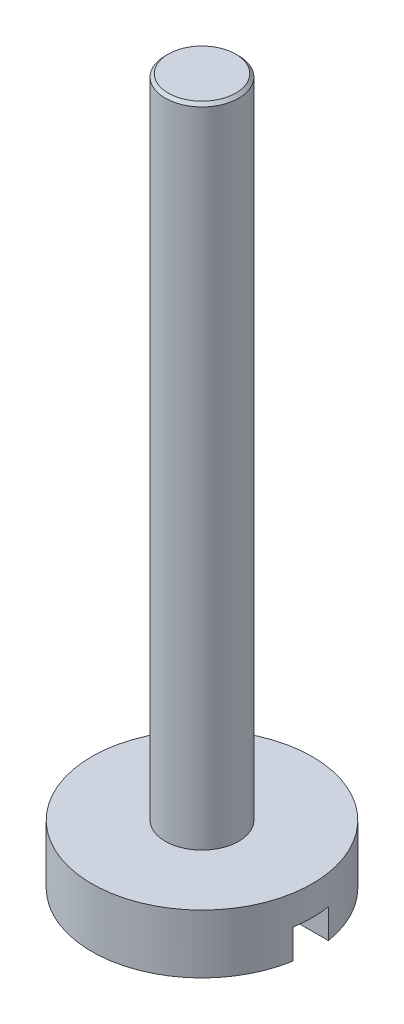
ISO-10303-21;
HEADER;
FILE_DESCRIPTION(('STEP AP214'),'2;1');
FILE_NAME('part.step','',(''),(''),'','','');
FILE_SCHEMA(('AUTOMOTIVE_DESIGN { 1 0 10303 214 1 1 1 1 }'));
ENDSEC;
DATA;
#1=APPLICATION_CONTEXT('core data for automotive mechanical design processes');
#2=APPLICATION_PROTOCOL_DEFINITION('international standard','automotive_design',2000,#1);
#3=PRODUCT_CONTEXT('',#1,'mechanical');
#4=PRODUCT('Part','Part','',(#3));
#5=PRODUCT_RELATED_PRODUCT_CATEGORY('part','',(#4));
#6=PRODUCT_DEFINITION_FORMATION('','',#4);
#7=PRODUCT_DEFINITION_CONTEXT('part definition',#1,'design');
#8=PRODUCT_DEFINITION('design','',#6,#7);
#9=PRODUCT_DEFINITION_SHAPE('','',#8);
#10=(LENGTH_UNIT() NAMED_UNIT(*) SI_UNIT(.MILLI.,.METRE.));
#11=(NAMED_UNIT(*) PLANE_ANGLE_UNIT() SI_UNIT($,.RADIAN.));
#12=(NAMED_UNIT(*) SI_UNIT($,.STERADIAN.) SOLID_ANGLE_UNIT());
#13=UNCERTAINTY_MEASURE_WITH_UNIT(LENGTH_MEASURE(1.E-05),#10,'distance_accuracy_value','');
#14=(GEOMETRIC_REPRESENTATION_CONTEXT(3) GLOBAL_UNCERTAINTY_ASSIGNED_CONTEXT((#13)) GLOBAL_UNIT_ASSIGNED_CONTEXT((#10,
#11,#12)) REPRESENTATION_CONTEXT('',''));
#15=CARTESIAN_POINT('',(0.,0.,0.));
#16=DIRECTION('',(0.,0.,1.));
#17=DIRECTION('',(1.,0.,0.));
#18=AXIS2_PLACEMENT_3D('',#15,#16,#17);
#19=CARTESIAN_POINT('',(0.,-1.,0.));
#20=DIRECTION('',(0.,-1.,0.));
#21=DIRECTION('',(0.,0.,-1.));
#22=AXIS2_PLACEMENT_3D('',#19,#20,#21);
#23=PLANE('',#22);
#24=DIRECTION('',(1.,0.,0.));
#25=VECTOR('',#24,1.);
#26=CARTESIAN_POINT('',(0.,-1.,-0.3));
#27=LINE('',#26,#25);
#28=CARTESIAN_POINT('',(-1.85084440188796,-1.,-0.3));
#29=VERTEX_POINT('',#28);
#30=CARTESIAN_POINT('',(1.85084440188796,-1.,-0.3));
#31=VERTEX_POINT('',#30);
#32=EDGE_CURVE('E90',#29,#31,#27,.T.);
#33=ORIENTED_EDGE('',*,*,#32,.F.);
#34=CARTESIAN_POINT('',(0.,-1.,0.));
#35=DIRECTION('',(0.,-1.,0.));
#36=DIRECTION('',(0.,0.,-1.));
#37=AXIS2_PLACEMENT_3D('',#34,#35,#36);
#38=CIRCLE('',#37,1.875);
#39=EDGE_CURVE('E100',#29,#31,#38,.T.);
#40=ORIENTED_EDGE('',*,*,#39,.T.);
#41=EDGE_LOOP('',(#33,#40));
#42=FACE_BOUND('',#41,.T.);
#43=ADVANCED_FACE('F42',(#42),#23,.T.);
#44=CARTESIAN_POINT('',(0.,-1.,0.));
#45=DIRECTION('',(0.,1.,0.));
#46=DIRECTION('',(0.,0.,1.));
#47=AXIS2_PLACEMENT_3D('',#44,#45,#46);
#48=CYLINDRICAL_SURFACE('',#47,1.875);
#49=CARTESIAN_POINT('',(0.,-0.5,0.));
#50=DIRECTION('',(0.,1.,0.));
#51=DIRECTION('',(0.,0.,1.));
#52=AXIS2_PLACEMENT_3D('',#49,#50,#51);
#53=CIRCLE('',#52,1.875);
#54=CARTESIAN_POINT('',(1.85084440188796,-0.5,0.3));
#55=VERTEX_POINT('',#54);
#56=CARTESIAN_POINT('',(1.85084440188796,-0.5,-0.3));
#57=VERTEX_POINT('',#56);
#58=EDGE_CURVE('E12',#55,#57,#53,.T.);
#59=ORIENTED_EDGE('',*,*,#58,.T.);
#60=DIRECTION('',(0.,1.,0.));
#61=VECTOR('',#60,1.);
#62=CARTESIAN_POINT('',(1.85084440188796,-1.,-0.3));
#63=LINE('',#62,#61);
#64=EDGE_CURVE('E65',#57,#31,#63,.F.);
#65=ORIENTED_EDGE('',*,*,#64,.T.);
#66=ORIENTED_EDGE('',*,*,#39,.F.);
#67=DIRECTION('',(0.,1.,0.));
#68=VECTOR('',#67,1.);
#69=CARTESIAN_POINT('',(-1.85084440188796,-1.,-0.3));
#70=LINE('',#69,#68);
#71=CARTESIAN_POINT('',(-1.85084440188796,-0.5,-0.3));
#72=VERTEX_POINT('',#71);
#73=EDGE_CURVE('E106',#29,#72,#70,.T.);
#74=ORIENTED_EDGE('',*,*,#73,.T.);
#75=CARTESIAN_POINT('',(-1.85084440188796,-0.5,0.3));
#76=VERTEX_POINT('',#75);
#77=EDGE_CURVE('E46',#72,#76,#53,.T.);
#78=ORIENTED_EDGE('',*,*,#77,.T.);
#79=DIRECTION('',(0.,1.,0.));
#80=VECTOR('',#79,1.);
#81=CARTESIAN_POINT('',(-1.85084440188796,-1.,0.3));
#82=LINE('',#81,#80);
#83=CARTESIAN_POINT('',(-1.85084440188796,-1.,0.3));
#84=VERTEX_POINT('',#83);
#85=EDGE_CURVE('E85',#76,#84,#82,.F.);
#86=ORIENTED_EDGE('',*,*,#85,.T.);
#87=CARTESIAN_POINT('',(1.85084440188796,-1.,0.3));
#88=VERTEX_POINT('',#87);
#89=EDGE_CURVE('E91',#88,#84,#38,.T.);
#90=ORIENTED_EDGE('',*,*,#89,.F.);
#91=DIRECTION('',(0.,1.,0.));
#92=VECTOR('',#91,1.);
#93=CARTESIAN_POINT('',(1.85084440188796,-1.,0.3));
#94=LINE('',#93,#92);
#95=EDGE_CURVE('E57',#88,#55,#94,.T.);
#96=ORIENTED_EDGE('',*,*,#95,.T.);
#97=EDGE_LOOP('',(#59,#65,#66,#74,#78,#86,#90,#96));
#98=FACE_BOUND('',#97,.T.);
#99=CARTESIAN_POINT('',(0.,0.,0.));
#100=DIRECTION('',(0.,-1.,0.));
#101=DIRECTION('',(0.,0.,-1.));
#102=AXIS2_PLACEMENT_3D('',#99,#100,#101);
#103=CIRCLE('',#102,1.875);
#104=CARTESIAN_POINT('',(0.,0.,-1.875));
#105=VERTEX_POINT('',#104);
#106=EDGE_CURVE('E103',#105,#105,#103,.T.);
#107=ORIENTED_EDGE('',*,*,#106,.T.);
#108=EDGE_LOOP('',(#107));
#109=FACE_BOUND('',#108,.T.);
#110=ADVANCED_FACE('F44',(#98,#109),#48,.T.);
#111=DIRECTION('',(-1.,0.,0.));
#112=VECTOR('',#111,1.);
#113=CARTESIAN_POINT('',(0.,-1.,0.3));
#114=LINE('',#113,#112);
#115=EDGE_CURVE('E82',#88,#84,#114,.T.);
#116=ORIENTED_EDGE('',*,*,#115,.F.);
#117=ORIENTED_EDGE('',*,*,#89,.T.);
#118=EDGE_LOOP('',(#116,#117));
#119=FACE_BOUND('',#118,.T.);
#120=ADVANCED_FACE('F99',(#119),#23,.T.);
#121=CARTESIAN_POINT('',(0.,0.,0.));
#122=DIRECTION('',(0.,-1.,0.));
#123=DIRECTION('',(0.,0.,-1.));
#124=AXIS2_PLACEMENT_3D('',#121,#122,#123);
#125=PLANE('',#124);
#126=ORIENTED_EDGE('',*,*,#106,.F.);
#127=EDGE_LOOP('',(#126));
#128=FACE_BOUND('',#127,.T.);
#129=ADVANCED_FACE('F120',(#128),#125,.F.);
#130=CARTESIAN_POINT('',(0.,-0.5,0.));
#131=DIRECTION('',(0.,1.,0.));
#132=DIRECTION('',(0.,0.,1.));
#133=AXIS2_PLACEMENT_3D('',#130,#131,#132);
#134=PLANE('',#133);
#135=DIRECTION('',(-1.,0.,0.));
#136=VECTOR('',#135,1.);
#137=CARTESIAN_POINT('',(-4.09817586391625,-0.5,0.3));
#138=LINE('',#137,#136);
#139=EDGE_CURVE('E171',#55,#76,#138,.T.);
#140=ORIENTED_EDGE('',*,*,#139,.T.);
#141=ORIENTED_EDGE('',*,*,#77,.F.);
#142=DIRECTION('',(1.,0.,0.));
#143=VECTOR('',#142,1.);
#144=CARTESIAN_POINT('',(-4.09817586391625,-0.5,-0.3));
#145=LINE('',#144,#143);
#146=EDGE_CURVE('E97',#72,#57,#145,.T.);
#147=ORIENTED_EDGE('',*,*,#146,.T.);
#148=ORIENTED_EDGE('',*,*,#58,.F.);
#149=EDGE_LOOP('',(#140,#141,#147,#148));
#150=FACE_BOUND('',#149,.T.);
#151=ADVANCED_FACE('F124',(#150),#134,.F.);
#152=CARTESIAN_POINT('',(-4.09817586391625,-0.5,-0.3));
#153=DIRECTION('',(0.,0.,-1.));
#154=DIRECTION('',(-1.,0.,0.));
#155=AXIS2_PLACEMENT_3D('',#152,#153,#154);
#156=PLANE('',#155);
#157=ORIENTED_EDGE('',*,*,#32,.T.);
#158=ORIENTED_EDGE('',*,*,#64,.F.);
#159=ORIENTED_EDGE('',*,*,#146,.F.);
#160=ORIENTED_EDGE('',*,*,#73,.F.);
#161=EDGE_LOOP('',(#157,#158,#159,#160));
#162=FACE_BOUND('',#161,.T.);
#163=ADVANCED_FACE('F110',(#162),#156,.F.);
#164=CARTESIAN_POINT('',(-4.09817586391625,-0.5,0.3));
#165=DIRECTION('',(0.,0.,1.));
#166=DIRECTION('',(1.,0.,0.));
#167=AXIS2_PLACEMENT_3D('',#164,#165,#166);
#168=PLANE('',#167);
#169=ORIENTED_EDGE('',*,*,#115,.T.);
#170=ORIENTED_EDGE('',*,*,#85,.F.);
#171=ORIENTED_EDGE('',*,*,#139,.F.);
#172=ORIENTED_EDGE('',*,*,#95,.F.);
#173=EDGE_LOOP('',(#169,#170,#171,#172));
#174=FACE_BOUND('',#173,.T.);
#175=ADVANCED_FACE('F84',(#174),#168,.F.);
#176=CLOSED_SHELL('',(#43,#110,#120,#129,#151,#163,#175));
#177=MANIFOLD_SOLID_BREP('B2',#176);
#178=CARTESIAN_POINT('',(0.,11.,0.));
#179=DIRECTION('',(0.,-1.,0.));
#180=DIRECTION('',(0.,0.,-1.));
#181=AXIS2_PLACEMENT_3D('',#178,#179,#180);
#182=CYLINDRICAL_SURFACE('',#181,0.625);
#183=CARTESIAN_POINT('',(0.,10.95,0.));
#184=DIRECTION('',(0.,1.,0.));
#185=DIRECTION('',(0.,0.,1.));
#186=AXIS2_PLACEMENT_3D('',#183,#184,#185);
#187=CIRCLE('',#186,0.625);
#188=CARTESIAN_POINT('',(0.,10.95,0.625));
#189=VERTEX_POINT('',#188);
#190=EDGE_CURVE('E41',#189,#189,#187,.F.);
#191=ORIENTED_EDGE('',*,*,#190,.T.);
#192=EDGE_LOOP('',(#191));
#193=FACE_BOUND('',#192,.T.);
#194=CARTESIAN_POINT('',(0.,0.,0.));
#195=DIRECTION('',(0.,1.,0.));
#196=DIRECTION('',(0.,0.,1.));
#197=AXIS2_PLACEMENT_3D('',#194,#195,#196);
#198=CIRCLE('',#197,0.625);
#199=CARTESIAN_POINT('',(0.,0.,0.625));
#200=VERTEX_POINT('',#199);
#201=EDGE_CURVE('E188',#200,#200,#198,.T.);
#202=ORIENTED_EDGE('',*,*,#201,.T.);
#203=EDGE_LOOP('',(#202));
#204=FACE_BOUND('',#203,.T.);
#205=ADVANCED_FACE('F177',(#193,#204),#182,.T.);
#206=CARTESIAN_POINT('',(0.,11.,0.));
#207=DIRECTION('',(0.,1.,0.));
#208=DIRECTION('',(0.,0.,1.));
#209=AXIS2_PLACEMENT_3D('',#206,#207,#208);
#210=PLANE('',#209);
#211=CARTESIAN_POINT('',(0.,11.,0.));
#212=DIRECTION('',(0.,1.,0.));
#213=DIRECTION('',(0.,0.,1.));
#214=AXIS2_PLACEMENT_3D('',#211,#212,#213);
#215=CIRCLE('',#214,0.575000000000001);
#216=CARTESIAN_POINT('',(0.,11.,0.575000000000001));
#217=VERTEX_POINT('',#216);
#218=EDGE_CURVE('E184',#217,#217,#215,.T.);
#219=ORIENTED_EDGE('',*,*,#218,.T.);
#220=EDGE_LOOP('',(#219));
#221=FACE_BOUND('',#220,.T.);
#222=ADVANCED_FACE('F198',(#221),#210,.T.);
#223=CARTESIAN_POINT('',(0.,0.,0.));
#224=DIRECTION('',(0.,1.,0.));
#225=DIRECTION('',(0.,0.,1.));
#226=AXIS2_PLACEMENT_3D('',#223,#224,#225);
#227=PLANE('',#226);
#228=ORIENTED_EDGE('',*,*,#201,.F.);
#229=EDGE_LOOP('',(#228));
#230=FACE_BOUND('',#229,.T.);
#231=ADVANCED_FACE('F196',(#230),#227,.F.);
#232=CARTESIAN_POINT('',(0.,11.,0.));
#233=DIRECTION('',(0.,-1.,0.));
#234=DIRECTION('',(0.,0.,-1.));
#235=AXIS2_PLACEMENT_3D('',#232,#233,#234);
#236=CONICAL_SURFACE('',#235,0.575000000000001,0.785398163397443);
#237=ORIENTED_EDGE('',*,*,#190,.F.);
#238=EDGE_LOOP('',(#237));
#239=FACE_BOUND('',#238,.T.);
#240=ORIENTED_EDGE('',*,*,#218,.F.);
#241=EDGE_LOOP('',(#240));
#242=FACE_BOUND('',#241,.T.);
#243=ADVANCED_FACE('F179',(#239,#242),#236,.T.);
#244=CLOSED_SHELL('',(#205,#222,#231,#243));
#245=MANIFOLD_SOLID_BREP('B6',#244);
#246=ADVANCED_BREP_SHAPE_REPRESENTATION('',(#18,#177,#245),#14);
#247=SHAPE_DEFINITION_REPRESENTATION(#9,#246);
ENDSEC;
END-ISO-10303-21;
